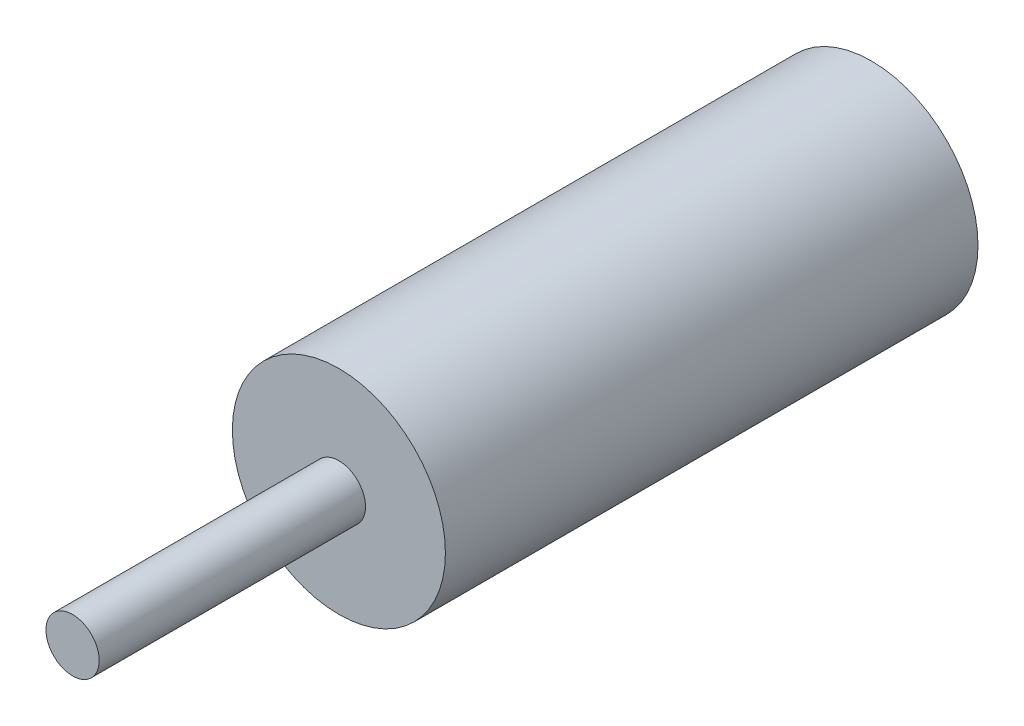
ISO-10303-21;
HEADER;
FILE_DESCRIPTION(('STEP AP214'),'2;1');
FILE_NAME('part.step','',(''),(''),'','','');
FILE_SCHEMA(('AUTOMOTIVE_DESIGN { 1 0 10303 214 1 1 1 1 }'));
ENDSEC;
DATA;
#1=APPLICATION_CONTEXT('core data for automotive mechanical design processes');
#2=APPLICATION_PROTOCOL_DEFINITION('international standard','automotive_design',2000,#1);
#3=PRODUCT_CONTEXT('',#1,'mechanical');
#4=PRODUCT('Part','Part','',(#3));
#5=PRODUCT_RELATED_PRODUCT_CATEGORY('part','',(#4));
#6=PRODUCT_DEFINITION_FORMATION('','',#4);
#7=PRODUCT_DEFINITION_CONTEXT('part definition',#1,'design');
#8=PRODUCT_DEFINITION('design','',#6,#7);
#9=PRODUCT_DEFINITION_SHAPE('','',#8);
#10=(LENGTH_UNIT() NAMED_UNIT(*) SI_UNIT(.MILLI.,.METRE.));
#11=(NAMED_UNIT(*) PLANE_ANGLE_UNIT() SI_UNIT($,.RADIAN.));
#12=(NAMED_UNIT(*) SI_UNIT($,.STERADIAN.) SOLID_ANGLE_UNIT());
#13=UNCERTAINTY_MEASURE_WITH_UNIT(LENGTH_MEASURE(1.E-05),#10,'distance_accuracy_value','');
#14=(GEOMETRIC_REPRESENTATION_CONTEXT(3) GLOBAL_UNCERTAINTY_ASSIGNED_CONTEXT((#13)) GLOBAL_UNIT_ASSIGNED_CONTEXT((#10,
#11,#12)) REPRESENTATION_CONTEXT('',''));
#15=CARTESIAN_POINT('',(0.,0.,0.));
#16=DIRECTION('',(0.,0.,1.));
#17=DIRECTION('',(1.,0.,0.));
#18=AXIS2_PLACEMENT_3D('',#15,#16,#17);
#19=CARTESIAN_POINT('',(0.,0.,20.));
#20=DIRECTION('',(0.,0.,-1.));
#21=DIRECTION('',(-1.,0.,0.));
#22=AXIS2_PLACEMENT_3D('',#19,#20,#21);
#23=CYLINDRICAL_SURFACE('',#22,4.);
#24=CARTESIAN_POINT('',(0.,0.,20.));
#25=DIRECTION('',(0.,0.,1.));
#26=DIRECTION('',(1.,0.,0.));
#27=AXIS2_PLACEMENT_3D('',#24,#25,#26);
#28=CIRCLE('',#27,4.);
#29=CARTESIAN_POINT('',(4.,0.,20.));
#30=VERTEX_POINT('',#29);
#31=EDGE_CURVE('E10',#30,#30,#28,.T.);
#32=ORIENTED_EDGE('',*,*,#31,.F.);
#33=EDGE_LOOP('',(#32));
#34=FACE_BOUND('',#33,.T.);
#35=CARTESIAN_POINT('',(0.,0.,0.));
#36=DIRECTION('',(0.,0.,1.));
#37=DIRECTION('',(1.,0.,0.));
#38=AXIS2_PLACEMENT_3D('',#35,#36,#37);
#39=CIRCLE('',#38,4.);
#40=CARTESIAN_POINT('',(4.,0.,0.));
#41=VERTEX_POINT('',#40);
#42=EDGE_CURVE('E42',#41,#41,#39,.T.);
#43=ORIENTED_EDGE('',*,*,#42,.T.);
#44=EDGE_LOOP('',(#43));
#45=FACE_BOUND('',#44,.T.);
#46=ADVANCED_FACE('F39',(#34,#45),#23,.T.);
#47=CARTESIAN_POINT('',(0.,0.,20.));
#48=DIRECTION('',(0.,0.,1.));
#49=DIRECTION('',(1.,0.,0.));
#50=AXIS2_PLACEMENT_3D('',#47,#48,#49);
#51=PLANE('',#50);
#52=CARTESIAN_POINT('',(0.,0.,20.));
#53=DIRECTION('',(0.,0.,1.));
#54=DIRECTION('',(1.,0.,0.));
#55=AXIS2_PLACEMENT_3D('',#52,#53,#54);
#56=CIRCLE('',#55,1.);
#57=CARTESIAN_POINT('',(1.,0.,20.));
#58=VERTEX_POINT('',#57);
#59=EDGE_CURVE('E51',#58,#58,#56,.F.);
#60=ORIENTED_EDGE('',*,*,#59,.T.);
#61=EDGE_LOOP('',(#60));
#62=FACE_BOUND('',#61,.T.);
#63=ORIENTED_EDGE('',*,*,#31,.T.);
#64=EDGE_LOOP('',(#63));
#65=FACE_BOUND('',#64,.T.);
#66=ADVANCED_FACE('F73',(#62,#65),#51,.T.);
#67=CARTESIAN_POINT('',(0.,0.,0.));
#68=DIRECTION('',(0.,0.,1.));
#69=DIRECTION('',(1.,0.,0.));
#70=AXIS2_PLACEMENT_3D('',#67,#68,#69);
#71=PLANE('',#70);
#72=ORIENTED_EDGE('',*,*,#42,.F.);
#73=EDGE_LOOP('',(#72));
#74=FACE_BOUND('',#73,.T.);
#75=ADVANCED_FACE('F65',(#74),#71,.F.);
#76=CARTESIAN_POINT('',(0.,0.,30.));
#77=DIRECTION('',(0.,0.,-1.));
#78=DIRECTION('',(-1.,0.,0.));
#79=AXIS2_PLACEMENT_3D('',#76,#77,#78);
#80=CYLINDRICAL_SURFACE('',#79,1.);
#81=ORIENTED_EDGE('',*,*,#59,.F.);
#82=EDGE_LOOP('',(#81));
#83=FACE_BOUND('',#82,.T.);
#84=CARTESIAN_POINT('',(0.,0.,30.));
#85=DIRECTION('',(0.,0.,1.));
#86=DIRECTION('',(1.,0.,0.));
#87=AXIS2_PLACEMENT_3D('',#84,#85,#86);
#88=CIRCLE('',#87,1.);
#89=CARTESIAN_POINT('',(1.,0.,30.));
#90=VERTEX_POINT('',#89);
#91=EDGE_CURVE('E56',#90,#90,#88,.T.);
#92=ORIENTED_EDGE('',*,*,#91,.F.);
#93=EDGE_LOOP('',(#92));
#94=FACE_BOUND('',#93,.T.);
#95=ADVANCED_FACE('F63',(#83,#94),#80,.T.);
#96=CARTESIAN_POINT('',(0.,0.,30.));
#97=DIRECTION('',(0.,0.,1.));
#98=DIRECTION('',(1.,0.,0.));
#99=AXIS2_PLACEMENT_3D('',#96,#97,#98);
#100=PLANE('',#99);
#101=ORIENTED_EDGE('',*,*,#91,.T.);
#102=EDGE_LOOP('',(#101));
#103=FACE_BOUND('',#102,.T.);
#104=ADVANCED_FACE('F61',(#103),#100,.T.);
#105=CLOSED_SHELL('',(#46,#66,#75,#95,#104));
#106=MANIFOLD_SOLID_BREP('B2',#105);
#107=ADVANCED_BREP_SHAPE_REPRESENTATION('',(#18,#106),#14);
#108=SHAPE_DEFINITION_REPRESENTATION(#9,#107);
ENDSEC;
END-ISO-10303-21;
